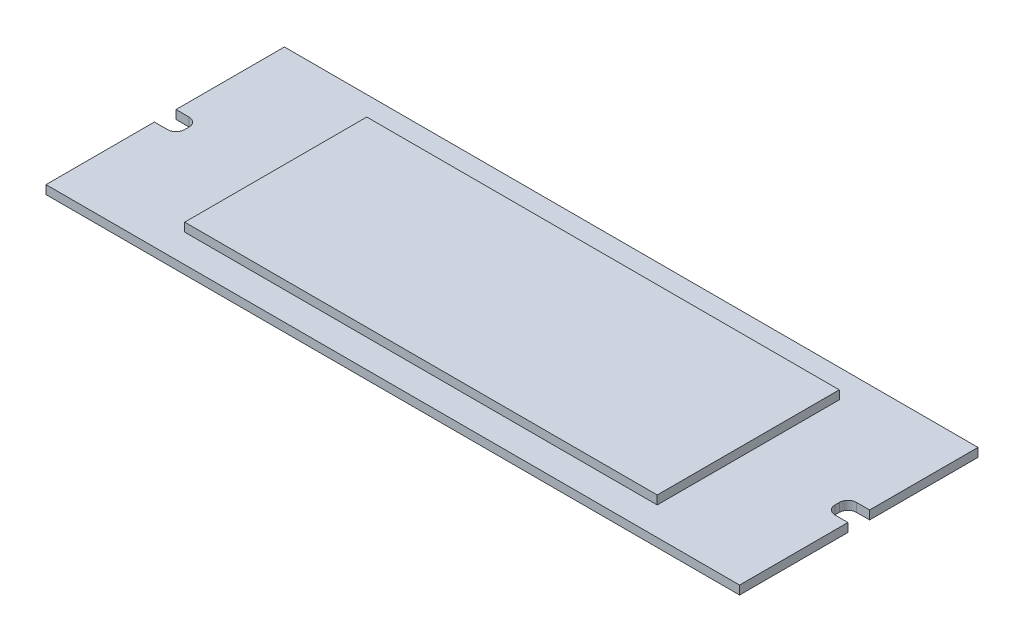
ISO-10303-21;
HEADER;
FILE_DESCRIPTION(('STEP AP214'),'2;1');
FILE_NAME('part.step','',(''),(''),'','','');
FILE_SCHEMA(('AUTOMOTIVE_DESIGN { 1 0 10303 214 1 1 1 1 }'));
ENDSEC;
DATA;
#1=APPLICATION_CONTEXT('core data for automotive mechanical design processes');
#2=APPLICATION_PROTOCOL_DEFINITION('international standard','automotive_design',2000,#1);
#3=PRODUCT_CONTEXT('',#1,'mechanical');
#4=PRODUCT('Part','Part','',(#3));
#5=PRODUCT_RELATED_PRODUCT_CATEGORY('part','',(#4));
#6=PRODUCT_DEFINITION_FORMATION('','',#4);
#7=PRODUCT_DEFINITION_CONTEXT('part definition',#1,'design');
#8=PRODUCT_DEFINITION('design','',#6,#7);
#9=PRODUCT_DEFINITION_SHAPE('','',#8);
#10=(LENGTH_UNIT() NAMED_UNIT(*) SI_UNIT(.MILLI.,.METRE.));
#11=(NAMED_UNIT(*) PLANE_ANGLE_UNIT() SI_UNIT($,.RADIAN.));
#12=(NAMED_UNIT(*) SI_UNIT($,.STERADIAN.) SOLID_ANGLE_UNIT());
#13=UNCERTAINTY_MEASURE_WITH_UNIT(LENGTH_MEASURE(1.E-05),#10,'distance_accuracy_value','');
#14=(GEOMETRIC_REPRESENTATION_CONTEXT(3) GLOBAL_UNCERTAINTY_ASSIGNED_CONTEXT((#13)) GLOBAL_UNIT_ASSIGNED_CONTEXT((#10,
#11,#12)) REPRESENTATION_CONTEXT('',''));
#15=CARTESIAN_POINT('',(0.,0.,0.));
#16=DIRECTION('',(0.,0.,1.));
#17=DIRECTION('',(1.,0.,0.));
#18=AXIS2_PLACEMENT_3D('',#15,#16,#17);
#19=CARTESIAN_POINT('',(101.028856200696,2.,-27.1090696762843));
#20=DIRECTION('',(-1.,0.,0.));
#21=DIRECTION('',(0.,0.,1.));
#22=AXIS2_PLACEMENT_3D('',#19,#20,#21);
#23=PLANE('',#22);
#24=DIRECTION('',(0.,0.,-1.));
#25=VECTOR('',#24,1.);
#26=CARTESIAN_POINT('',(101.028856200696,0.,-27.1090696762843));
#27=LINE('',#26,#25);
#28=CARTESIAN_POINT('',(101.028856200695,0.,27.8909303237157));
#29=VERTEX_POINT('',#28);
#30=CARTESIAN_POINT('',(101.028856200695,0.,2.89093032371565));
#31=VERTEX_POINT('',#30);
#32=EDGE_CURVE('E194',#29,#31,#27,.T.);
#33=ORIENTED_EDGE('',*,*,#32,.T.);
#34=DIRECTION('',(0.,1.,0.));
#35=VECTOR('',#34,1.);
#36=CARTESIAN_POINT('',(101.028856200695,0.,2.89093032371565));
#37=LINE('',#36,#35);
#38=CARTESIAN_POINT('',(101.028856200695,2.,2.89093032371565));
#39=VERTEX_POINT('',#38);
#40=EDGE_CURVE('E244',#31,#39,#37,.T.);
#41=ORIENTED_EDGE('',*,*,#40,.T.);
#42=DIRECTION('',(0.,0.,-1.));
#43=VECTOR('',#42,1.);
#44=CARTESIAN_POINT('',(101.028856200696,2.,-27.1090696762843));
#45=LINE('',#44,#43);
#46=CARTESIAN_POINT('',(101.028856200695,2.,27.8909303237157));
#47=VERTEX_POINT('',#46);
#48=EDGE_CURVE('E216',#47,#39,#45,.T.);
#49=ORIENTED_EDGE('',*,*,#48,.F.);
#50=DIRECTION('',(0.,-1.,0.));
#51=VECTOR('',#50,1.);
#52=CARTESIAN_POINT('',(101.028856200695,2.,27.8909303237157));
#53=LINE('',#52,#51);
#54=EDGE_CURVE('E41',#47,#29,#53,.T.);
#55=ORIENTED_EDGE('',*,*,#54,.T.);
#56=EDGE_LOOP('',(#33,#41,#49,#55));
#57=FACE_BOUND('',#56,.T.);
#58=ADVANCED_FACE('F33',(#57),#23,.F.);
#59=CARTESIAN_POINT('',(-58.9711437993045,2.,-27.1090696762843));
#60=DIRECTION('',(1.,0.,0.));
#61=DIRECTION('',(0.,0.,-1.));
#62=AXIS2_PLACEMENT_3D('',#59,#60,#61);
#63=PLANE('',#62);
#64=DIRECTION('',(0.,0.,1.));
#65=VECTOR('',#64,1.);
#66=CARTESIAN_POINT('',(-58.9711437993045,0.,-27.1090696762843));
#67=LINE('',#66,#65);
#68=CARTESIAN_POINT('',(-58.9711437993045,0.,-27.1090696762843));
#69=VERTEX_POINT('',#68);
#70=CARTESIAN_POINT('',(-58.9711437993045,0.,-2.10906967628435));
#71=VERTEX_POINT('',#70);
#72=EDGE_CURVE('E198',#69,#71,#67,.T.);
#73=ORIENTED_EDGE('',*,*,#72,.T.);
#74=DIRECTION('',(0.,1.,0.));
#75=VECTOR('',#74,1.);
#76=CARTESIAN_POINT('',(-58.9711437993045,0.,-2.10906967628435));
#77=LINE('',#76,#75);
#78=CARTESIAN_POINT('',(-58.9711437993045,2.,-2.10906967628435));
#79=VERTEX_POINT('',#78);
#80=EDGE_CURVE('E281',#71,#79,#77,.T.);
#81=ORIENTED_EDGE('',*,*,#80,.T.);
#82=DIRECTION('',(0.,0.,1.));
#83=VECTOR('',#82,1.);
#84=CARTESIAN_POINT('',(-58.9711437993045,2.,-27.1090696762843));
#85=LINE('',#84,#83);
#86=CARTESIAN_POINT('',(-58.9711437993045,2.,-27.1090696762843));
#87=VERTEX_POINT('',#86);
#88=EDGE_CURVE('E323',#87,#79,#85,.T.);
#89=ORIENTED_EDGE('',*,*,#88,.F.);
#90=DIRECTION('',(0.,-1.,0.));
#91=VECTOR('',#90,1.);
#92=CARTESIAN_POINT('',(-58.9711437993045,2.,-27.1090696762843));
#93=LINE('',#92,#91);
#94=EDGE_CURVE('E204',#87,#69,#93,.T.);
#95=ORIENTED_EDGE('',*,*,#94,.T.);
#96=EDGE_LOOP('',(#73,#81,#89,#95));
#97=FACE_BOUND('',#96,.T.);
#98=ADVANCED_FACE('F357',(#97),#63,.F.);
#99=CARTESIAN_POINT('',(0.,2.,0.));
#100=DIRECTION('',(0.,1.,0.));
#101=DIRECTION('',(0.,0.,1.));
#102=AXIS2_PLACEMENT_3D('',#99,#100,#101);
#103=PLANE('',#102);
#104=DIRECTION('',(1.,0.,0.));
#105=VECTOR('',#104,1.);
#106=CARTESIAN_POINT('',(101.028856200695,2.,2.89093032371565));
#107=LINE('',#106,#105);
#108=CARTESIAN_POINT('',(98.0288562006955,2.,2.89093032371565));
#109=VERTEX_POINT('',#108);
#110=EDGE_CURVE('E178',#109,#39,#107,.T.);
#111=ORIENTED_EDGE('',*,*,#110,.F.);
#112=CARTESIAN_POINT('',(98.0288562006955,2.,0.89093032371565));
#113=DIRECTION('',(0.,1.,0.));
#114=DIRECTION('',(0.,0.,-1.));
#115=AXIS2_PLACEMENT_3D('',#112,#113,#114);
#116=CIRCLE('',#115,2.);
#117=CARTESIAN_POINT('',(96.0288562006955,2.,0.890930323715635));
#118=VERTEX_POINT('',#117);
#119=EDGE_CURVE('E240',#118,#109,#116,.T.);
#120=ORIENTED_EDGE('',*,*,#119,.F.);
#121=DIRECTION('',(0.,0.,1.));
#122=VECTOR('',#121,1.);
#123=CARTESIAN_POINT('',(96.0288562006955,2.,-0.109069676284336));
#124=LINE('',#123,#122);
#125=CARTESIAN_POINT('',(96.0288562006955,2.,-0.109069676284337));
#126=VERTEX_POINT('',#125);
#127=EDGE_CURVE('E237',#126,#118,#124,.T.);
#128=ORIENTED_EDGE('',*,*,#127,.F.);
#129=CARTESIAN_POINT('',(98.0288562006955,2.,-0.10906967628435));
#130=DIRECTION('',(0.,1.,0.));
#131=DIRECTION('',(0.,0.,1.));
#132=AXIS2_PLACEMENT_3D('',#129,#130,#131);
#133=CIRCLE('',#132,2.);
#134=CARTESIAN_POINT('',(98.0288562006955,2.,-2.10906967628435));
#135=VERTEX_POINT('',#134);
#136=EDGE_CURVE('E234',#135,#126,#133,.T.);
#137=ORIENTED_EDGE('',*,*,#136,.F.);
#138=DIRECTION('',(-1.,0.,0.));
#139=VECTOR('',#138,1.);
#140=CARTESIAN_POINT('',(101.028856200695,2.,-2.10906967628435));
#141=LINE('',#140,#139);
#142=CARTESIAN_POINT('',(101.028856200695,2.,-2.10906967628435));
#143=VERTEX_POINT('',#142);
#144=EDGE_CURVE('E232',#143,#135,#141,.T.);
#145=ORIENTED_EDGE('',*,*,#144,.F.);
#146=CARTESIAN_POINT('',(101.028856200696,2.,-27.1090696762843));
#147=VERTEX_POINT('',#146);
#148=EDGE_CURVE('E186',#143,#147,#45,.T.);
#149=ORIENTED_EDGE('',*,*,#148,.T.);
#150=DIRECTION('',(-1.,0.,0.));
#151=VECTOR('',#150,1.);
#152=CARTESIAN_POINT('',(-58.9711437993045,2.,-27.1090696762843));
#153=LINE('',#152,#151);
#154=EDGE_CURVE('E208',#147,#87,#153,.T.);
#155=ORIENTED_EDGE('',*,*,#154,.T.);
#156=ORIENTED_EDGE('',*,*,#88,.T.);
#157=DIRECTION('',(-1.,0.,0.));
#158=VECTOR('',#157,1.);
#159=CARTESIAN_POINT('',(-58.9711437993045,2.,-2.10906967628435));
#160=LINE('',#159,#158);
#161=CARTESIAN_POINT('',(-55.9711437993045,2.,-2.10906967628433));
#162=VERTEX_POINT('',#161);
#163=EDGE_CURVE('E257',#162,#79,#160,.T.);
#164=ORIENTED_EDGE('',*,*,#163,.F.);
#165=CARTESIAN_POINT('',(-55.9711437993045,2.,-0.109069676284352));
#166=DIRECTION('',(0.,1.,0.));
#167=DIRECTION('',(0.,0.,-1.));
#168=AXIS2_PLACEMENT_3D('',#165,#166,#167);
#169=CIRCLE('',#168,2.);
#170=CARTESIAN_POINT('',(-53.9711437993045,2.,-0.109069676284327));
#171=VERTEX_POINT('',#170);
#172=EDGE_CURVE('E277',#171,#162,#169,.T.);
#173=ORIENTED_EDGE('',*,*,#172,.F.);
#174=DIRECTION('',(0.,0.,-1.));
#175=VECTOR('',#174,1.);
#176=CARTESIAN_POINT('',(-53.9711437993045,2.,-0.109069676284328));
#177=LINE('',#176,#175);
#178=CARTESIAN_POINT('',(-53.9711437993045,2.,0.890930323715634));
#179=VERTEX_POINT('',#178);
#180=EDGE_CURVE('E274',#179,#171,#177,.T.);
#181=ORIENTED_EDGE('',*,*,#180,.F.);
#182=CARTESIAN_POINT('',(-55.9711437993045,2.,0.890930323715648));
#183=DIRECTION('',(0.,1.,0.));
#184=DIRECTION('',(0.,0.,1.));
#185=AXIS2_PLACEMENT_3D('',#182,#183,#184);
#186=CIRCLE('',#185,2.);
#187=CARTESIAN_POINT('',(-55.9711437993045,2.,2.89093032371565));
#188=VERTEX_POINT('',#187);
#189=EDGE_CURVE('E271',#188,#179,#186,.T.);
#190=ORIENTED_EDGE('',*,*,#189,.F.);
#191=DIRECTION('',(1.,0.,0.));
#192=VECTOR('',#191,1.);
#193=CARTESIAN_POINT('',(-58.9711437993045,2.,2.89093032371565));
#194=LINE('',#193,#192);
#195=CARTESIAN_POINT('',(-58.9711437993045,2.,2.89093032371565));
#196=VERTEX_POINT('',#195);
#197=EDGE_CURVE('E246',#196,#188,#194,.T.);
#198=ORIENTED_EDGE('',*,*,#197,.F.);
#199=CARTESIAN_POINT('',(-58.9711437993045,2.,27.8909303237157));
#200=VERTEX_POINT('',#199);
#201=EDGE_CURVE('E203',#196,#200,#85,.T.);
#202=ORIENTED_EDGE('',*,*,#201,.T.);
#203=DIRECTION('',(1.,0.,0.));
#204=VECTOR('',#203,1.);
#205=CARTESIAN_POINT('',(-58.9711437993045,2.,27.8909303237157));
#206=LINE('',#205,#204);
#207=EDGE_CURVE('E326',#200,#47,#206,.T.);
#208=ORIENTED_EDGE('',*,*,#207,.T.);
#209=ORIENTED_EDGE('',*,*,#48,.T.);
#210=EDGE_LOOP('',(#111,#120,#128,#137,#145,#149,#155,#156,#164,#173,#181,#190,#198,#202,#208,#209));
#211=FACE_BOUND('',#210,.T.);
#212=DIRECTION('',(1.,0.,0.));
#213=VECTOR('',#212,1.);
#214=CARTESIAN_POINT('',(-33.4711437993045,2.,21.3909303237157));
#215=LINE('',#214,#213);
#216=CARTESIAN_POINT('',(-33.4711437993045,2.,21.3909303237157));
#217=VERTEX_POINT('',#216);
#218=CARTESIAN_POINT('',(75.5288562006955,2.,21.3909303237157));
#219=VERTEX_POINT('',#218);
#220=EDGE_CURVE('E307',#217,#219,#215,.T.);
#221=ORIENTED_EDGE('',*,*,#220,.F.);
#222=DIRECTION('',(0.,0.,1.));
#223=VECTOR('',#222,1.);
#224=CARTESIAN_POINT('',(-33.4711437993045,2.,21.3909303237157));
#225=LINE('',#224,#223);
#226=CARTESIAN_POINT('',(-33.4711437993045,2.,-20.6090696762843));
#227=VERTEX_POINT('',#226);
#228=EDGE_CURVE('E284',#227,#217,#225,.T.);
#229=ORIENTED_EDGE('',*,*,#228,.F.);
#230=DIRECTION('',(-1.,0.,0.));
#231=VECTOR('',#230,1.);
#232=CARTESIAN_POINT('',(-33.4711437993045,2.,-20.6090696762843));
#233=LINE('',#232,#231);
#234=CARTESIAN_POINT('',(75.5288562006955,2.,-20.6090696762843));
#235=VERTEX_POINT('',#234);
#236=EDGE_CURVE('E298',#235,#227,#233,.T.);
#237=ORIENTED_EDGE('',*,*,#236,.F.);
#238=DIRECTION('',(0.,0.,-1.));
#239=VECTOR('',#238,1.);
#240=CARTESIAN_POINT('',(75.5288562006955,2.,21.3909303237157));
#241=LINE('',#240,#239);
#242=EDGE_CURVE('E309',#219,#235,#241,.T.);
#243=ORIENTED_EDGE('',*,*,#242,.F.);
#244=EDGE_LOOP('',(#221,#229,#237,#243));
#245=FACE_BOUND('',#244,.T.);
#246=ADVANCED_FACE('F345',(#211,#245),#103,.T.);
#247=ORIENTED_EDGE('',*,*,#201,.F.);
#248=DIRECTION('',(0.,1.,0.));
#249=VECTOR('',#248,1.);
#250=CARTESIAN_POINT('',(-58.9711437993045,0.,2.89093032371565));
#251=LINE('',#250,#249);
#252=CARTESIAN_POINT('',(-58.9711437993045,0.,2.89093032371565));
#253=VERTEX_POINT('',#252);
#254=EDGE_CURVE('E268',#253,#196,#251,.T.);
#255=ORIENTED_EDGE('',*,*,#254,.F.);
#256=CARTESIAN_POINT('',(-58.9711437993045,0.,27.8909303237157));
#257=VERTEX_POINT('',#256);
#258=EDGE_CURVE('E322',#253,#257,#67,.T.);
#259=ORIENTED_EDGE('',*,*,#258,.T.);
#260=DIRECTION('',(0.,-1.,0.));
#261=VECTOR('',#260,1.);
#262=CARTESIAN_POINT('',(-58.9711437993045,2.,27.8909303237157));
#263=LINE('',#262,#261);
#264=EDGE_CURVE('E11',#200,#257,#263,.T.);
#265=ORIENTED_EDGE('',*,*,#264,.F.);
#266=EDGE_LOOP('',(#247,#255,#259,#265));
#267=FACE_BOUND('',#266,.T.);
#268=ADVANCED_FACE('F35',(#267),#63,.F.);
#269=CARTESIAN_POINT('',(-58.9711437993045,2.,27.8909303237157));
#270=DIRECTION('',(0.,0.,-1.));
#271=DIRECTION('',(-1.,0.,0.));
#272=AXIS2_PLACEMENT_3D('',#269,#270,#271);
#273=PLANE('',#272);
#274=DIRECTION('',(1.,0.,0.));
#275=VECTOR('',#274,1.);
#276=CARTESIAN_POINT('',(-58.9711437993045,0.,27.8909303237157));
#277=LINE('',#276,#275);
#278=EDGE_CURVE('E195',#257,#29,#277,.T.);
#279=ORIENTED_EDGE('',*,*,#278,.T.);
#280=ORIENTED_EDGE('',*,*,#54,.F.);
#281=ORIENTED_EDGE('',*,*,#207,.F.);
#282=ORIENTED_EDGE('',*,*,#264,.T.);
#283=EDGE_LOOP('',(#279,#280,#281,#282));
#284=FACE_BOUND('',#283,.T.);
#285=ADVANCED_FACE('F370',(#284),#273,.F.);
#286=ORIENTED_EDGE('',*,*,#148,.F.);
#287=DIRECTION('',(0.,1.,0.));
#288=VECTOR('',#287,1.);
#289=CARTESIAN_POINT('',(101.028856200695,0.,-2.10906967628435));
#290=LINE('',#289,#288);
#291=CARTESIAN_POINT('',(101.028856200695,0.,-2.10906967628435));
#292=VERTEX_POINT('',#291);
#293=EDGE_CURVE('E173',#292,#143,#290,.T.);
#294=ORIENTED_EDGE('',*,*,#293,.F.);
#295=CARTESIAN_POINT('',(101.028856200696,0.,-27.1090696762843));
#296=VERTEX_POINT('',#295);
#297=EDGE_CURVE('E184',#292,#296,#27,.T.);
#298=ORIENTED_EDGE('',*,*,#297,.T.);
#299=DIRECTION('',(0.,-1.,0.));
#300=VECTOR('',#299,1.);
#301=CARTESIAN_POINT('',(101.028856200696,2.,-27.1090696762843));
#302=LINE('',#301,#300);
#303=EDGE_CURVE('E207',#147,#296,#302,.T.);
#304=ORIENTED_EDGE('',*,*,#303,.F.);
#305=EDGE_LOOP('',(#286,#294,#298,#304));
#306=FACE_BOUND('',#305,.T.);
#307=ADVANCED_FACE('F182',(#306),#23,.F.);
#308=CARTESIAN_POINT('',(-58.9711437993045,2.,-27.1090696762843));
#309=DIRECTION('',(0.,0.,1.));
#310=DIRECTION('',(1.,0.,0.));
#311=AXIS2_PLACEMENT_3D('',#308,#309,#310);
#312=PLANE('',#311);
#313=DIRECTION('',(-1.,0.,0.));
#314=VECTOR('',#313,1.);
#315=CARTESIAN_POINT('',(-58.9711437993045,0.,-27.1090696762843));
#316=LINE('',#315,#314);
#317=EDGE_CURVE('E193',#296,#69,#316,.T.);
#318=ORIENTED_EDGE('',*,*,#317,.T.);
#319=ORIENTED_EDGE('',*,*,#94,.F.);
#320=ORIENTED_EDGE('',*,*,#154,.F.);
#321=ORIENTED_EDGE('',*,*,#303,.T.);
#322=EDGE_LOOP('',(#318,#319,#320,#321));
#323=FACE_BOUND('',#322,.T.);
#324=ADVANCED_FACE('F361',(#323),#312,.F.);
#325=CARTESIAN_POINT('',(0.,0.,0.));
#326=DIRECTION('',(0.,1.,0.));
#327=DIRECTION('',(0.,0.,1.));
#328=AXIS2_PLACEMENT_3D('',#325,#326,#327);
#329=PLANE('',#328);
#330=CARTESIAN_POINT('',(98.0288562006955,0.,0.89093032371565));
#331=DIRECTION('',(0.,1.,0.));
#332=DIRECTION('',(0.,0.,-1.));
#333=AXIS2_PLACEMENT_3D('',#330,#331,#332);
#334=CIRCLE('',#333,2.);
#335=CARTESIAN_POINT('',(96.0288562006955,0.,0.890930323715635));
#336=VERTEX_POINT('',#335);
#337=CARTESIAN_POINT('',(98.0288562006955,0.,2.89093032371565));
#338=VERTEX_POINT('',#337);
#339=EDGE_CURVE('E225',#336,#338,#334,.T.);
#340=ORIENTED_EDGE('',*,*,#339,.T.);
#341=DIRECTION('',(1.,0.,0.));
#342=VECTOR('',#341,1.);
#343=CARTESIAN_POINT('',(101.028856200695,0.,2.89093032371565));
#344=LINE('',#343,#342);
#345=EDGE_CURVE('E187',#338,#31,#344,.T.);
#346=ORIENTED_EDGE('',*,*,#345,.T.);
#347=ORIENTED_EDGE('',*,*,#32,.F.);
#348=ORIENTED_EDGE('',*,*,#278,.F.);
#349=ORIENTED_EDGE('',*,*,#258,.F.);
#350=DIRECTION('',(1.,0.,0.));
#351=VECTOR('',#350,1.);
#352=CARTESIAN_POINT('',(-58.9711437993045,0.,2.89093032371565));
#353=LINE('',#352,#351);
#354=CARTESIAN_POINT('',(-55.9711437993045,0.,2.89093032371565));
#355=VERTEX_POINT('',#354);
#356=EDGE_CURVE('E254',#253,#355,#353,.T.);
#357=ORIENTED_EDGE('',*,*,#356,.T.);
#358=CARTESIAN_POINT('',(-55.9711437993045,0.,0.890930323715648));
#359=DIRECTION('',(0.,1.,0.));
#360=DIRECTION('',(0.,0.,1.));
#361=AXIS2_PLACEMENT_3D('',#358,#359,#360);
#362=CIRCLE('',#361,2.);
#363=CARTESIAN_POINT('',(-53.9711437993045,0.,0.890930323715634));
#364=VERTEX_POINT('',#363);
#365=EDGE_CURVE('E56',#355,#364,#362,.T.);
#366=ORIENTED_EDGE('',*,*,#365,.T.);
#367=DIRECTION('',(0.,0.,-1.));
#368=VECTOR('',#367,1.);
#369=CARTESIAN_POINT('',(-53.9711437993045,0.,-0.109069676284328));
#370=LINE('',#369,#368);
#371=CARTESIAN_POINT('',(-53.9711437993045,0.,-0.109069676284327));
#372=VERTEX_POINT('',#371);
#373=EDGE_CURVE('E259',#364,#372,#370,.T.);
#374=ORIENTED_EDGE('',*,*,#373,.T.);
#375=CARTESIAN_POINT('',(-55.9711437993045,0.,-0.109069676284352));
#376=DIRECTION('',(0.,1.,0.));
#377=DIRECTION('',(0.,0.,-1.));
#378=AXIS2_PLACEMENT_3D('',#375,#376,#377);
#379=CIRCLE('',#378,2.);
#380=CARTESIAN_POINT('',(-55.9711437993045,0.,-2.10906967628433));
#381=VERTEX_POINT('',#380);
#382=EDGE_CURVE('E262',#372,#381,#379,.T.);
#383=ORIENTED_EDGE('',*,*,#382,.T.);
#384=DIRECTION('',(-1.,0.,0.));
#385=VECTOR('',#384,1.);
#386=CARTESIAN_POINT('',(-58.9711437993045,0.,-2.10906967628435));
#387=LINE('',#386,#385);
#388=EDGE_CURVE('E265',#381,#71,#387,.T.);
#389=ORIENTED_EDGE('',*,*,#388,.T.);
#390=ORIENTED_EDGE('',*,*,#72,.F.);
#391=ORIENTED_EDGE('',*,*,#317,.F.);
#392=ORIENTED_EDGE('',*,*,#297,.F.);
#393=DIRECTION('',(-1.,0.,0.));
#394=VECTOR('',#393,1.);
#395=CARTESIAN_POINT('',(101.028856200695,0.,-2.10906967628435));
#396=LINE('',#395,#394);
#397=CARTESIAN_POINT('',(98.0288562006955,0.,-2.10906967628435));
#398=VERTEX_POINT('',#397);
#399=EDGE_CURVE('E169',#292,#398,#396,.T.);
#400=ORIENTED_EDGE('',*,*,#399,.T.);
#401=CARTESIAN_POINT('',(98.0288562006955,0.,-0.10906967628435));
#402=DIRECTION('',(0.,1.,0.));
#403=DIRECTION('',(0.,0.,1.));
#404=AXIS2_PLACEMENT_3D('',#401,#402,#403);
#405=CIRCLE('',#404,2.);
#406=CARTESIAN_POINT('',(96.0288562006955,0.,-0.109069676284337));
#407=VERTEX_POINT('',#406);
#408=EDGE_CURVE('E48',#398,#407,#405,.T.);
#409=ORIENTED_EDGE('',*,*,#408,.T.);
#410=DIRECTION('',(0.,0.,1.));
#411=VECTOR('',#410,1.);
#412=CARTESIAN_POINT('',(96.0288562006955,0.,-0.109069676284336));
#413=LINE('',#412,#411);
#414=EDGE_CURVE('E228',#407,#336,#413,.T.);
#415=ORIENTED_EDGE('',*,*,#414,.T.);
#416=EDGE_LOOP('',(#340,#346,#347,#348,#349,#357,#366,#374,#383,#389,#390,#391,#392,#400,#409,#415));
#417=FACE_BOUND('',#416,.T.);
#418=ADVANCED_FACE('F191',(#417),#329,.F.);
#419=CARTESIAN_POINT('',(-33.4711437993045,4.,21.3909303237157));
#420=DIRECTION('',(1.,0.,0.));
#421=DIRECTION('',(0.,0.,-1.));
#422=AXIS2_PLACEMENT_3D('',#419,#420,#421);
#423=PLANE('',#422);
#424=ORIENTED_EDGE('',*,*,#228,.T.);
#425=DIRECTION('',(0.,-1.,0.));
#426=VECTOR('',#425,1.);
#427=CARTESIAN_POINT('',(-33.4711437993045,4.,21.3909303237157));
#428=LINE('',#427,#426);
#429=CARTESIAN_POINT('',(-33.4711437993045,4.,21.3909303237157));
#430=VERTEX_POINT('',#429);
#431=EDGE_CURVE('E320',#430,#217,#428,.T.);
#432=ORIENTED_EDGE('',*,*,#431,.F.);
#433=DIRECTION('',(0.,0.,1.));
#434=VECTOR('',#433,1.);
#435=CARTESIAN_POINT('',(-33.4711437993045,4.,21.3909303237157));
#436=LINE('',#435,#434);
#437=CARTESIAN_POINT('',(-33.4711437993045,4.,-20.6090696762843));
#438=VERTEX_POINT('',#437);
#439=EDGE_CURVE('E294',#438,#430,#436,.T.);
#440=ORIENTED_EDGE('',*,*,#439,.F.);
#441=DIRECTION('',(0.,-1.,0.));
#442=VECTOR('',#441,1.);
#443=CARTESIAN_POINT('',(-33.4711437993045,4.,-20.6090696762843));
#444=LINE('',#443,#442);
#445=EDGE_CURVE('E304',#438,#227,#444,.T.);
#446=ORIENTED_EDGE('',*,*,#445,.T.);
#447=EDGE_LOOP('',(#424,#432,#440,#446));
#448=FACE_BOUND('',#447,.T.);
#449=ADVANCED_FACE('F368',(#448),#423,.F.);
#450=CARTESIAN_POINT('',(-33.4711437993045,4.,21.3909303237157));
#451=DIRECTION('',(0.,0.,-1.));
#452=DIRECTION('',(-1.,0.,0.));
#453=AXIS2_PLACEMENT_3D('',#450,#451,#452);
#454=PLANE('',#453);
#455=ORIENTED_EDGE('',*,*,#220,.T.);
#456=DIRECTION('',(0.,-1.,0.));
#457=VECTOR('',#456,1.);
#458=CARTESIAN_POINT('',(75.5288562006955,4.,21.3909303237157));
#459=LINE('',#458,#457);
#460=CARTESIAN_POINT('',(75.5288562006955,4.,21.3909303237157));
#461=VERTEX_POINT('',#460);
#462=EDGE_CURVE('E317',#461,#219,#459,.T.);
#463=ORIENTED_EDGE('',*,*,#462,.F.);
#464=DIRECTION('',(1.,0.,0.));
#465=VECTOR('',#464,1.);
#466=CARTESIAN_POINT('',(-33.4711437993045,4.,21.3909303237157));
#467=LINE('',#466,#465);
#468=EDGE_CURVE('E297',#430,#461,#467,.T.);
#469=ORIENTED_EDGE('',*,*,#468,.F.);
#470=ORIENTED_EDGE('',*,*,#431,.T.);
#471=EDGE_LOOP('',(#455,#463,#469,#470));
#472=FACE_BOUND('',#471,.T.);
#473=ADVANCED_FACE('F422',(#472),#454,.F.);
#474=CARTESIAN_POINT('',(75.5288562006955,4.,21.3909303237157));
#475=DIRECTION('',(-1.,0.,0.));
#476=DIRECTION('',(0.,0.,1.));
#477=AXIS2_PLACEMENT_3D('',#474,#475,#476);
#478=PLANE('',#477);
#479=ORIENTED_EDGE('',*,*,#242,.T.);
#480=DIRECTION('',(0.,-1.,0.));
#481=VECTOR('',#480,1.);
#482=CARTESIAN_POINT('',(75.5288562006955,4.,-20.6090696762843));
#483=LINE('',#482,#481);
#484=CARTESIAN_POINT('',(75.5288562006955,4.,-20.6090696762843));
#485=VERTEX_POINT('',#484);
#486=EDGE_CURVE('E315',#485,#235,#483,.T.);
#487=ORIENTED_EDGE('',*,*,#486,.F.);
#488=DIRECTION('',(0.,0.,-1.));
#489=VECTOR('',#488,1.);
#490=CARTESIAN_POINT('',(75.5288562006955,4.,21.3909303237157));
#491=LINE('',#490,#489);
#492=EDGE_CURVE('E300',#461,#485,#491,.T.);
#493=ORIENTED_EDGE('',*,*,#492,.F.);
#494=ORIENTED_EDGE('',*,*,#462,.T.);
#495=EDGE_LOOP('',(#479,#487,#493,#494));
#496=FACE_BOUND('',#495,.T.);
#497=ADVANCED_FACE('F418',(#496),#478,.F.);
#498=CARTESIAN_POINT('',(-33.4711437993045,4.,-20.6090696762843));
#499=DIRECTION('',(0.,0.,1.));
#500=DIRECTION('',(1.,0.,0.));
#501=AXIS2_PLACEMENT_3D('',#498,#499,#500);
#502=PLANE('',#501);
#503=ORIENTED_EDGE('',*,*,#236,.T.);
#504=ORIENTED_EDGE('',*,*,#445,.F.);
#505=DIRECTION('',(-1.,0.,0.));
#506=VECTOR('',#505,1.);
#507=CARTESIAN_POINT('',(-33.4711437993045,4.,-20.6090696762843));
#508=LINE('',#507,#506);
#509=EDGE_CURVE('E302',#485,#438,#508,.T.);
#510=ORIENTED_EDGE('',*,*,#509,.F.);
#511=ORIENTED_EDGE('',*,*,#486,.T.);
#512=EDGE_LOOP('',(#503,#504,#510,#511));
#513=FACE_BOUND('',#512,.T.);
#514=ADVANCED_FACE('F414',(#513),#502,.F.);
#515=CARTESIAN_POINT('',(0.,4.,0.));
#516=DIRECTION('',(0.,-1.,0.));
#517=DIRECTION('',(0.,0.,-1.));
#518=AXIS2_PLACEMENT_3D('',#515,#516,#517);
#519=PLANE('',#518);
#520=ORIENTED_EDGE('',*,*,#439,.T.);
#521=ORIENTED_EDGE('',*,*,#468,.T.);
#522=ORIENTED_EDGE('',*,*,#492,.T.);
#523=ORIENTED_EDGE('',*,*,#509,.T.);
#524=EDGE_LOOP('',(#520,#521,#522,#523));
#525=FACE_BOUND('',#524,.T.);
#526=ADVANCED_FACE('F403',(#525),#519,.F.);
#527=CARTESIAN_POINT('',(-58.9711437993045,0.,-2.10906967628435));
#528=DIRECTION('',(0.,0.,-1.));
#529=DIRECTION('',(-1.,0.,0.));
#530=AXIS2_PLACEMENT_3D('',#527,#528,#529);
#531=PLANE('',#530);
#532=ORIENTED_EDGE('',*,*,#163,.T.);
#533=ORIENTED_EDGE('',*,*,#80,.F.);
#534=ORIENTED_EDGE('',*,*,#388,.F.);
#535=DIRECTION('',(0.,1.,0.));
#536=VECTOR('',#535,1.);
#537=CARTESIAN_POINT('',(-55.9711437993045,0.,-2.10906967628433));
#538=LINE('',#537,#536);
#539=EDGE_CURVE('E285',#381,#162,#538,.T.);
#540=ORIENTED_EDGE('',*,*,#539,.T.);
#541=EDGE_LOOP('',(#532,#533,#534,#540));
#542=FACE_BOUND('',#541,.T.);
#543=ADVANCED_FACE('F355',(#542),#531,.F.);
#544=CARTESIAN_POINT('',(-55.9711437993045,0.,-0.109069676284352));
#545=DIRECTION('',(0.,1.,0.));
#546=DIRECTION('',(0.,0.,1.));
#547=AXIS2_PLACEMENT_3D('',#544,#545,#546);
#548=CYLINDRICAL_SURFACE('',#547,2.);
#549=ORIENTED_EDGE('',*,*,#172,.T.);
#550=ORIENTED_EDGE('',*,*,#539,.F.);
#551=ORIENTED_EDGE('',*,*,#382,.F.);
#552=DIRECTION('',(0.,1.,0.));
#553=VECTOR('',#552,1.);
#554=CARTESIAN_POINT('',(-53.9711437993045,0.,-0.109069676284327));
#555=LINE('',#554,#553);
#556=EDGE_CURVE('E287',#372,#171,#555,.T.);
#557=ORIENTED_EDGE('',*,*,#556,.T.);
#558=EDGE_LOOP('',(#549,#550,#551,#557));
#559=FACE_BOUND('',#558,.T.);
#560=ADVANCED_FACE('F353',(#559),#548,.F.);
#561=CARTESIAN_POINT('',(-53.9711437993045,0.,-0.109069676284328));
#562=DIRECTION('',(1.,0.,0.));
#563=DIRECTION('',(0.,0.,-1.));
#564=AXIS2_PLACEMENT_3D('',#561,#562,#563);
#565=PLANE('',#564);
#566=ORIENTED_EDGE('',*,*,#180,.T.);
#567=ORIENTED_EDGE('',*,*,#556,.F.);
#568=ORIENTED_EDGE('',*,*,#373,.F.);
#569=DIRECTION('',(0.,1.,0.));
#570=VECTOR('',#569,1.);
#571=CARTESIAN_POINT('',(-53.9711437993045,0.,0.890930323715634));
#572=LINE('',#571,#570);
#573=EDGE_CURVE('E289',#364,#179,#572,.T.);
#574=ORIENTED_EDGE('',*,*,#573,.T.);
#575=EDGE_LOOP('',(#566,#567,#568,#574));
#576=FACE_BOUND('',#575,.T.);
#577=ADVANCED_FACE('F349',(#576),#565,.F.);
#578=CARTESIAN_POINT('',(-55.9711437993045,0.,0.890930323715648));
#579=DIRECTION('',(0.,1.,0.));
#580=DIRECTION('',(0.,0.,1.));
#581=AXIS2_PLACEMENT_3D('',#578,#579,#580);
#582=CYLINDRICAL_SURFACE('',#581,2.);
#583=ORIENTED_EDGE('',*,*,#189,.T.);
#584=ORIENTED_EDGE('',*,*,#573,.F.);
#585=ORIENTED_EDGE('',*,*,#365,.F.);
#586=DIRECTION('',(0.,1.,0.));
#587=VECTOR('',#586,1.);
#588=CARTESIAN_POINT('',(-55.9711437993045,0.,2.89093032371565));
#589=LINE('',#588,#587);
#590=EDGE_CURVE('E291',#355,#188,#589,.T.);
#591=ORIENTED_EDGE('',*,*,#590,.T.);
#592=EDGE_LOOP('',(#583,#584,#585,#591));
#593=FACE_BOUND('',#592,.T.);
#594=ADVANCED_FACE('F339',(#593),#582,.F.);
#595=CARTESIAN_POINT('',(-58.9711437993045,0.,2.89093032371565));
#596=DIRECTION('',(0.,0.,1.));
#597=DIRECTION('',(1.,0.,0.));
#598=AXIS2_PLACEMENT_3D('',#595,#596,#597);
#599=PLANE('',#598);
#600=ORIENTED_EDGE('',*,*,#197,.T.);
#601=ORIENTED_EDGE('',*,*,#590,.F.);
#602=ORIENTED_EDGE('',*,*,#356,.F.);
#603=ORIENTED_EDGE('',*,*,#254,.T.);
#604=EDGE_LOOP('',(#600,#601,#602,#603));
#605=FACE_BOUND('',#604,.T.);
#606=ADVANCED_FACE('F336',(#605),#599,.F.);
#607=CARTESIAN_POINT('',(101.028856200695,0.,2.89093032371565));
#608=DIRECTION('',(0.,0.,1.));
#609=DIRECTION('',(1.,0.,0.));
#610=AXIS2_PLACEMENT_3D('',#607,#608,#609);
#611=PLANE('',#610);
#612=ORIENTED_EDGE('',*,*,#110,.T.);
#613=ORIENTED_EDGE('',*,*,#40,.F.);
#614=ORIENTED_EDGE('',*,*,#345,.F.);
#615=DIRECTION('',(0.,1.,0.));
#616=VECTOR('',#615,1.);
#617=CARTESIAN_POINT('',(98.0288562006955,0.,2.89093032371565));
#618=LINE('',#617,#616);
#619=EDGE_CURVE('E247',#338,#109,#618,.T.);
#620=ORIENTED_EDGE('',*,*,#619,.T.);
#621=EDGE_LOOP('',(#612,#613,#614,#620));
#622=FACE_BOUND('',#621,.T.);
#623=ADVANCED_FACE('F382',(#622),#611,.F.);
#624=CARTESIAN_POINT('',(98.0288562006955,0.,0.89093032371565));
#625=DIRECTION('',(0.,1.,0.));
#626=DIRECTION('',(0.,0.,1.));
#627=AXIS2_PLACEMENT_3D('',#624,#625,#626);
#628=CYLINDRICAL_SURFACE('',#627,2.);
#629=ORIENTED_EDGE('',*,*,#119,.T.);
#630=ORIENTED_EDGE('',*,*,#619,.F.);
#631=ORIENTED_EDGE('',*,*,#339,.F.);
#632=DIRECTION('',(0.,1.,0.));
#633=VECTOR('',#632,1.);
#634=CARTESIAN_POINT('',(96.0288562006955,0.,0.890930323715635));
#635=LINE('',#634,#633);
#636=EDGE_CURVE('E249',#336,#118,#635,.T.);
#637=ORIENTED_EDGE('',*,*,#636,.T.);
#638=EDGE_LOOP('',(#629,#630,#631,#637));
#639=FACE_BOUND('',#638,.T.);
#640=ADVANCED_FACE('F384',(#639),#628,.F.);
#641=CARTESIAN_POINT('',(96.0288562006955,0.,-0.109069676284336));
#642=DIRECTION('',(-1.,0.,0.));
#643=DIRECTION('',(0.,0.,1.));
#644=AXIS2_PLACEMENT_3D('',#641,#642,#643);
#645=PLANE('',#644);
#646=ORIENTED_EDGE('',*,*,#127,.T.);
#647=ORIENTED_EDGE('',*,*,#636,.F.);
#648=ORIENTED_EDGE('',*,*,#414,.F.);
#649=DIRECTION('',(0.,1.,0.));
#650=VECTOR('',#649,1.);
#651=CARTESIAN_POINT('',(96.0288562006955,0.,-0.109069676284337));
#652=LINE('',#651,#650);
#653=EDGE_CURVE('E251',#407,#126,#652,.T.);
#654=ORIENTED_EDGE('',*,*,#653,.T.);
#655=EDGE_LOOP('',(#646,#647,#648,#654));
#656=FACE_BOUND('',#655,.T.);
#657=ADVANCED_FACE('F387',(#656),#645,.F.);
#658=CARTESIAN_POINT('',(98.0288562006955,0.,-0.10906967628435));
#659=DIRECTION('',(0.,1.,0.));
#660=DIRECTION('',(0.,0.,1.));
#661=AXIS2_PLACEMENT_3D('',#658,#659,#660);
#662=CYLINDRICAL_SURFACE('',#661,2.);
#663=ORIENTED_EDGE('',*,*,#136,.T.);
#664=ORIENTED_EDGE('',*,*,#653,.F.);
#665=ORIENTED_EDGE('',*,*,#408,.F.);
#666=DIRECTION('',(0.,1.,0.));
#667=VECTOR('',#666,1.);
#668=CARTESIAN_POINT('',(98.0288562006955,0.,-2.10906967628435));
#669=LINE('',#668,#667);
#670=EDGE_CURVE('E175',#398,#135,#669,.T.);
#671=ORIENTED_EDGE('',*,*,#670,.T.);
#672=EDGE_LOOP('',(#663,#664,#665,#671));
#673=FACE_BOUND('',#672,.T.);
#674=ADVANCED_FACE('F389',(#673),#662,.F.);
#675=CARTESIAN_POINT('',(101.028856200695,0.,-2.10906967628435));
#676=DIRECTION('',(0.,0.,-1.));
#677=DIRECTION('',(-1.,0.,0.));
#678=AXIS2_PLACEMENT_3D('',#675,#676,#677);
#679=PLANE('',#678);
#680=ORIENTED_EDGE('',*,*,#144,.T.);
#681=ORIENTED_EDGE('',*,*,#670,.F.);
#682=ORIENTED_EDGE('',*,*,#399,.F.);
#683=ORIENTED_EDGE('',*,*,#293,.T.);
#684=EDGE_LOOP('',(#680,#681,#682,#683));
#685=FACE_BOUND('',#684,.T.);
#686=ADVANCED_FACE('F172',(#685),#679,.F.);
#687=CLOSED_SHELL('',(#58,#98,#246,#268,#285,#307,#324,#418,#449,#473,#497,#514,#526,#543,#560,
#577,#594,#606,#623,#640,#657,#674,#686));
#688=MANIFOLD_SOLID_BREP('B2',#687);
#689=ADVANCED_BREP_SHAPE_REPRESENTATION('',(#18,#688),#14);
#690=SHAPE_DEFINITION_REPRESENTATION(#9,#689);
ENDSEC;
END-ISO-10303-21;
